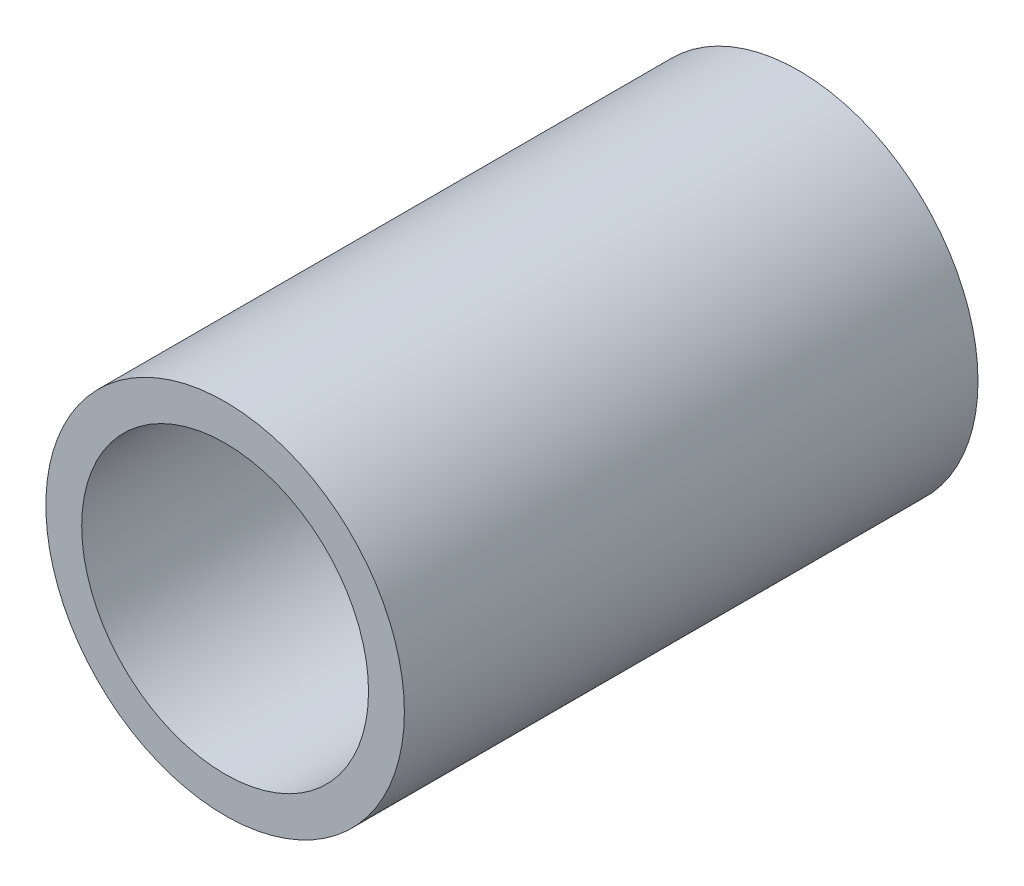
ISO-10303-21;
HEADER;
FILE_DESCRIPTION(('STEP AP214'),'2;1');
FILE_NAME('part.step','',(''),(''),'','','');
FILE_SCHEMA(('AUTOMOTIVE_DESIGN { 1 0 10303 214 1 1 1 1 }'));
ENDSEC;
DATA;
#1=APPLICATION_CONTEXT('core data for automotive mechanical design processes');
#2=APPLICATION_PROTOCOL_DEFINITION('international standard','automotive_design',2000,#1);
#3=PRODUCT_CONTEXT('',#1,'mechanical');
#4=PRODUCT('Part','Part','',(#3));
#5=PRODUCT_RELATED_PRODUCT_CATEGORY('part','',(#4));
#6=PRODUCT_DEFINITION_FORMATION('','',#4);
#7=PRODUCT_DEFINITION_CONTEXT('part definition',#1,'design');
#8=PRODUCT_DEFINITION('design','',#6,#7);
#9=PRODUCT_DEFINITION_SHAPE('','',#8);
#10=(LENGTH_UNIT() NAMED_UNIT(*) SI_UNIT(.MILLI.,.METRE.));
#11=(NAMED_UNIT(*) PLANE_ANGLE_UNIT() SI_UNIT($,.RADIAN.));
#12=(NAMED_UNIT(*) SI_UNIT($,.STERADIAN.) SOLID_ANGLE_UNIT());
#13=UNCERTAINTY_MEASURE_WITH_UNIT(LENGTH_MEASURE(1.E-05),#10,'distance_accuracy_value','');
#14=(GEOMETRIC_REPRESENTATION_CONTEXT(3) GLOBAL_UNCERTAINTY_ASSIGNED_CONTEXT((#13)) GLOBAL_UNIT_ASSIGNED_CONTEXT((#10,
#11,#12)) REPRESENTATION_CONTEXT('',''));
#15=CARTESIAN_POINT('',(0.,0.,0.));
#16=DIRECTION('',(0.,0.,1.));
#17=DIRECTION('',(1.,0.,0.));
#18=AXIS2_PLACEMENT_3D('',#15,#16,#17);
#19=CARTESIAN_POINT('',(0.,0.,50.8));
#20=DIRECTION('',(0.,0.,1.));
#21=DIRECTION('',(1.,0.,0.));
#22=AXIS2_PLACEMENT_3D('',#19,#20,#21);
#23=PLANE('',#22);
#24=CARTESIAN_POINT('',(0.,0.,50.8));
#25=DIRECTION('',(0.,0.,1.));
#26=DIRECTION('',(1.,0.,0.));
#27=AXIS2_PLACEMENT_3D('',#24,#25,#26);
#28=CIRCLE('',#27,15.875);
#29=CARTESIAN_POINT('',(15.875,0.,50.8));
#30=VERTEX_POINT('',#29);
#31=EDGE_CURVE('E10',#30,#30,#28,.T.);
#32=ORIENTED_EDGE('',*,*,#31,.T.);
#33=EDGE_LOOP('',(#32));
#34=FACE_BOUND('',#33,.T.);
#35=CARTESIAN_POINT('',(0.,0.,50.8));
#36=DIRECTION('',(0.,0.,1.));
#37=DIRECTION('',(1.,0.,0.));
#38=AXIS2_PLACEMENT_3D('',#35,#36,#37);
#39=CIRCLE('',#38,12.7);
#40=CARTESIAN_POINT('',(12.7,0.,50.8));
#41=VERTEX_POINT('',#40);
#42=EDGE_CURVE('E50',#41,#41,#39,.T.);
#43=ORIENTED_EDGE('',*,*,#42,.F.);
#44=EDGE_LOOP('',(#43));
#45=FACE_BOUND('',#44,.T.);
#46=ADVANCED_FACE('F39',(#34,#45),#23,.T.);
#47=CARTESIAN_POINT('',(0.,0.,0.));
#48=DIRECTION('',(0.,0.,1.));
#49=DIRECTION('',(1.,0.,0.));
#50=AXIS2_PLACEMENT_3D('',#47,#48,#49);
#51=PLANE('',#50);
#52=CARTESIAN_POINT('',(0.,0.,0.));
#53=DIRECTION('',(0.,0.,1.));
#54=DIRECTION('',(1.,0.,0.));
#55=AXIS2_PLACEMENT_3D('',#52,#53,#54);
#56=CIRCLE('',#55,15.875);
#57=CARTESIAN_POINT('',(15.875,0.,0.));
#58=VERTEX_POINT('',#57);
#59=EDGE_CURVE('E43',#58,#58,#56,.T.);
#60=ORIENTED_EDGE('',*,*,#59,.F.);
#61=EDGE_LOOP('',(#60));
#62=FACE_BOUND('',#61,.T.);
#63=CARTESIAN_POINT('',(0.,0.,0.));
#64=DIRECTION('',(0.,0.,1.));
#65=DIRECTION('',(1.,0.,0.));
#66=AXIS2_PLACEMENT_3D('',#63,#64,#65);
#67=CIRCLE('',#66,12.7);
#68=CARTESIAN_POINT('',(12.7,0.,0.));
#69=VERTEX_POINT('',#68);
#70=EDGE_CURVE('E52',#69,#69,#67,.T.);
#71=ORIENTED_EDGE('',*,*,#70,.T.);
#72=EDGE_LOOP('',(#71));
#73=FACE_BOUND('',#72,.T.);
#74=ADVANCED_FACE('F62',(#62,#73),#51,.F.);
#75=CARTESIAN_POINT('',(0.,0.,50.8));
#76=DIRECTION('',(0.,0.,-1.));
#77=DIRECTION('',(-1.,0.,0.));
#78=AXIS2_PLACEMENT_3D('',#75,#76,#77);
#79=CYLINDRICAL_SURFACE('',#78,15.875);
#80=ORIENTED_EDGE('',*,*,#31,.F.);
#81=EDGE_LOOP('',(#80));
#82=FACE_BOUND('',#81,.T.);
#83=ORIENTED_EDGE('',*,*,#59,.T.);
#84=EDGE_LOOP('',(#83));
#85=FACE_BOUND('',#84,.T.);
#86=ADVANCED_FACE('F41',(#82,#85),#79,.T.);
#87=CARTESIAN_POINT('',(0.,0.,50.8));
#88=DIRECTION('',(0.,0.,-1.));
#89=DIRECTION('',(-1.,0.,0.));
#90=AXIS2_PLACEMENT_3D('',#87,#88,#89);
#91=CYLINDRICAL_SURFACE('',#90,12.7);
#92=ORIENTED_EDGE('',*,*,#42,.T.);
#93=EDGE_LOOP('',(#92));
#94=FACE_BOUND('',#93,.T.);
#95=ORIENTED_EDGE('',*,*,#70,.F.);
#96=EDGE_LOOP('',(#95));
#97=FACE_BOUND('',#96,.T.);
#98=ADVANCED_FACE('F58',(#94,#97),#91,.F.);
#99=CLOSED_SHELL('',(#46,#74,#86,#98));
#100=MANIFOLD_SOLID_BREP('B2',#99);
#101=ADVANCED_BREP_SHAPE_REPRESENTATION('',(#18,#100),#14);
#102=SHAPE_DEFINITION_REPRESENTATION(#9,#101);
ENDSEC;
END-ISO-10303-21;
